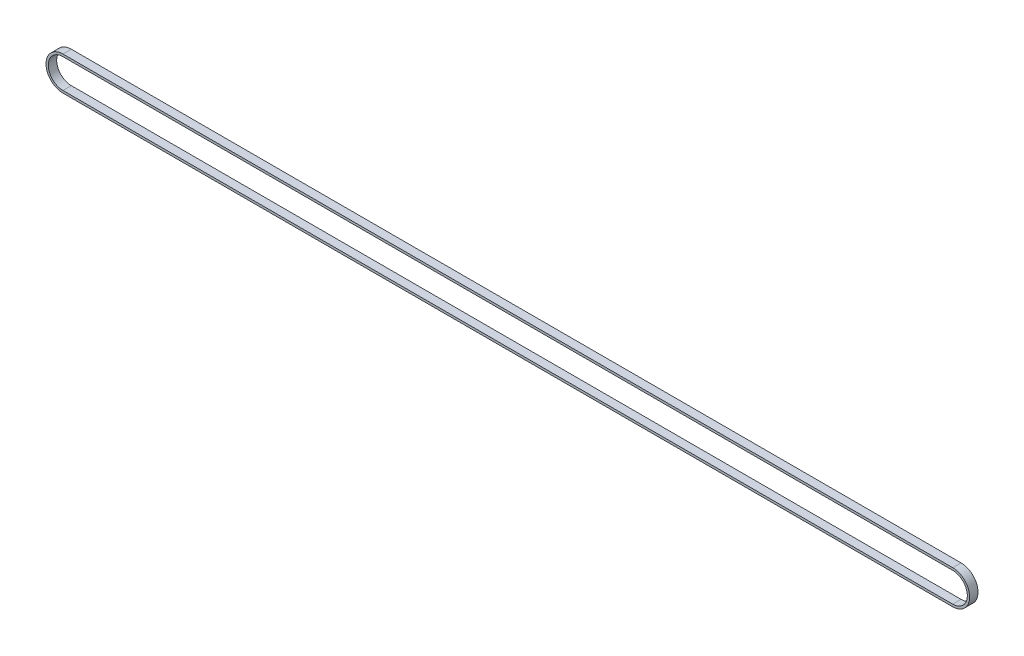
ISO-10303-21;
HEADER;
FILE_DESCRIPTION(('STEP AP214'),'2;1');
FILE_NAME('part.step','',(''),(''),'','','');
FILE_SCHEMA(('AUTOMOTIVE_DESIGN { 1 0 10303 214 1 1 1 1 }'));
ENDSEC;
DATA;
#1=APPLICATION_CONTEXT('core data for automotive mechanical design processes');
#2=APPLICATION_PROTOCOL_DEFINITION('international standard','automotive_design',2000,#1);
#3=PRODUCT_CONTEXT('',#1,'mechanical');
#4=PRODUCT('Part','Part','',(#3));
#5=PRODUCT_RELATED_PRODUCT_CATEGORY('part','',(#4));
#6=PRODUCT_DEFINITION_FORMATION('','',#4);
#7=PRODUCT_DEFINITION_CONTEXT('part definition',#1,'design');
#8=PRODUCT_DEFINITION('design','',#6,#7);
#9=PRODUCT_DEFINITION_SHAPE('','',#8);
#10=(LENGTH_UNIT() NAMED_UNIT(*) SI_UNIT(.MILLI.,.METRE.));
#11=(NAMED_UNIT(*) PLANE_ANGLE_UNIT() SI_UNIT($,.RADIAN.));
#12=(NAMED_UNIT(*) SI_UNIT($,.STERADIAN.) SOLID_ANGLE_UNIT());
#13=UNCERTAINTY_MEASURE_WITH_UNIT(LENGTH_MEASURE(1.E-05),#10,'distance_accuracy_value','');
#14=(GEOMETRIC_REPRESENTATION_CONTEXT(3) GLOBAL_UNCERTAINTY_ASSIGNED_CONTEXT((#13)) GLOBAL_UNIT_ASSIGNED_CONTEXT((#10,
#11,#12)) REPRESENTATION_CONTEXT('',''));
#15=CARTESIAN_POINT('',(0.,0.,0.));
#16=DIRECTION('',(0.,0.,1.));
#17=DIRECTION('',(1.,0.,0.));
#18=AXIS2_PLACEMENT_3D('',#15,#16,#17);
#19=CARTESIAN_POINT('',(0.,0.,2.5));
#20=DIRECTION('',(0.,0.,1.));
#21=DIRECTION('',(1.,0.,0.));
#22=AXIS2_PLACEMENT_3D('',#19,#20,#21);
#23=PLANE('',#22);
#24=CARTESIAN_POINT('',(0.,0.,2.5));
#25=DIRECTION('',(0.,0.,1.));
#26=DIRECTION('',(1.,0.,0.));
#27=AXIS2_PLACEMENT_3D('',#24,#25,#26);
#28=CIRCLE('',#27,10.13);
#29=CARTESIAN_POINT('',(0.,10.13,2.5));
#30=VERTEX_POINT('',#29);
#31=CARTESIAN_POINT('',(0.,-10.13,2.5));
#32=VERTEX_POINT('',#31);
#33=EDGE_CURVE('E157',#30,#32,#28,.T.);
#34=ORIENTED_EDGE('',*,*,#33,.T.);
#35=DIRECTION('',(1.,0.,0.));
#36=VECTOR('',#35,1.);
#37=CARTESIAN_POINT('',(532.,-10.13,2.5));
#38=LINE('',#37,#36);
#39=CARTESIAN_POINT('',(532.,-10.13,2.5));
#40=VERTEX_POINT('',#39);
#41=EDGE_CURVE('E160',#32,#40,#38,.T.);
#42=ORIENTED_EDGE('',*,*,#41,.T.);
#43=CARTESIAN_POINT('',(532.,0.,2.5));
#44=DIRECTION('',(0.,0.,1.));
#45=DIRECTION('',(1.,0.,0.));
#46=AXIS2_PLACEMENT_3D('',#43,#44,#45);
#47=CIRCLE('',#46,10.13);
#48=CARTESIAN_POINT('',(532.,10.13,2.5));
#49=VERTEX_POINT('',#48);
#50=EDGE_CURVE('E163',#40,#49,#47,.T.);
#51=ORIENTED_EDGE('',*,*,#50,.T.);
#52=DIRECTION('',(-1.,0.,0.));
#53=VECTOR('',#52,1.);
#54=CARTESIAN_POINT('',(0.,10.13,2.5));
#55=LINE('',#54,#53);
#56=EDGE_CURVE('E165',#49,#30,#55,.T.);
#57=ORIENTED_EDGE('',*,*,#56,.T.);
#58=EDGE_LOOP('',(#34,#42,#51,#57));
#59=FACE_BOUND('',#58,.T.);
#60=DIRECTION('',(1.,0.,0.));
#61=VECTOR('',#60,1.);
#62=CARTESIAN_POINT('',(532.,-8.75,2.5));
#63=LINE('',#62,#61);
#64=CARTESIAN_POINT('',(0.,-8.75,2.5));
#65=VERTEX_POINT('',#64);
#66=CARTESIAN_POINT('',(532.,-8.75,2.5));
#67=VERTEX_POINT('',#66);
#68=EDGE_CURVE('E129',#65,#67,#63,.T.);
#69=ORIENTED_EDGE('',*,*,#68,.F.);
#70=CARTESIAN_POINT('',(0.,0.,2.5));
#71=DIRECTION('',(0.,0.,1.));
#72=DIRECTION('',(1.,0.,0.));
#73=AXIS2_PLACEMENT_3D('',#70,#71,#72);
#74=CIRCLE('',#73,8.75);
#75=CARTESIAN_POINT('',(0.,8.75,2.5));
#76=VERTEX_POINT('',#75);
#77=EDGE_CURVE('E121',#76,#65,#74,.T.);
#78=ORIENTED_EDGE('',*,*,#77,.F.);
#79=DIRECTION('',(-1.,0.,0.));
#80=VECTOR('',#79,1.);
#81=CARTESIAN_POINT('',(0.,8.75,2.5));
#82=LINE('',#81,#80);
#83=CARTESIAN_POINT('',(532.,8.75,2.5));
#84=VERTEX_POINT('',#83);
#85=EDGE_CURVE('E143',#84,#76,#82,.T.);
#86=ORIENTED_EDGE('',*,*,#85,.F.);
#87=CARTESIAN_POINT('',(532.,0.,2.5));
#88=DIRECTION('',(0.,0.,1.));
#89=DIRECTION('',(1.,0.,0.));
#90=AXIS2_PLACEMENT_3D('',#87,#88,#89);
#91=CIRCLE('',#90,8.75);
#92=EDGE_CURVE('E141',#67,#84,#91,.T.);
#93=ORIENTED_EDGE('',*,*,#92,.F.);
#94=EDGE_LOOP('',(#69,#78,#86,#93));
#95=FACE_BOUND('',#94,.T.);
#96=ADVANCED_FACE('F56',(#59,#95),#23,.T.);
#97=CARTESIAN_POINT('',(0.,0.,-2.5));
#98=DIRECTION('',(0.,0.,1.));
#99=DIRECTION('',(1.,0.,0.));
#100=AXIS2_PLACEMENT_3D('',#97,#98,#99);
#101=PLANE('',#100);
#102=CARTESIAN_POINT('',(0.,0.,-2.5));
#103=DIRECTION('',(0.,0.,1.));
#104=DIRECTION('',(1.,0.,0.));
#105=AXIS2_PLACEMENT_3D('',#102,#103,#104);
#106=CIRCLE('',#105,10.13);
#107=CARTESIAN_POINT('',(0.,10.13,-2.5));
#108=VERTEX_POINT('',#107);
#109=CARTESIAN_POINT('',(0.,-10.13,-2.5));
#110=VERTEX_POINT('',#109);
#111=EDGE_CURVE('E137',#108,#110,#106,.T.);
#112=ORIENTED_EDGE('',*,*,#111,.F.);
#113=DIRECTION('',(-1.,0.,0.));
#114=VECTOR('',#113,1.);
#115=CARTESIAN_POINT('',(0.,10.13,-2.5));
#116=LINE('',#115,#114);
#117=CARTESIAN_POINT('',(532.,10.13,-2.5));
#118=VERTEX_POINT('',#117);
#119=EDGE_CURVE('E161',#118,#108,#116,.T.);
#120=ORIENTED_EDGE('',*,*,#119,.F.);
#121=CARTESIAN_POINT('',(532.,0.,-2.5));
#122=DIRECTION('',(0.,0.,1.));
#123=DIRECTION('',(1.,0.,0.));
#124=AXIS2_PLACEMENT_3D('',#121,#122,#123);
#125=CIRCLE('',#124,10.13);
#126=CARTESIAN_POINT('',(532.,-10.13,-2.5));
#127=VERTEX_POINT('',#126);
#128=EDGE_CURVE('E172',#127,#118,#125,.T.);
#129=ORIENTED_EDGE('',*,*,#128,.F.);
#130=DIRECTION('',(1.,0.,0.));
#131=VECTOR('',#130,1.);
#132=CARTESIAN_POINT('',(532.,-10.13,-2.5));
#133=LINE('',#132,#131);
#134=EDGE_CURVE('E170',#110,#127,#133,.T.);
#135=ORIENTED_EDGE('',*,*,#134,.F.);
#136=EDGE_LOOP('',(#112,#120,#129,#135));
#137=FACE_BOUND('',#136,.T.);
#138=CARTESIAN_POINT('',(0.,0.,-2.5));
#139=DIRECTION('',(0.,0.,1.));
#140=DIRECTION('',(1.,0.,0.));
#141=AXIS2_PLACEMENT_3D('',#138,#139,#140);
#142=CIRCLE('',#141,8.75);
#143=CARTESIAN_POINT('',(0.,8.75,-2.5));
#144=VERTEX_POINT('',#143);
#145=CARTESIAN_POINT('',(0.,-8.75,-2.5));
#146=VERTEX_POINT('',#145);
#147=EDGE_CURVE('E79',#144,#146,#142,.T.);
#148=ORIENTED_EDGE('',*,*,#147,.T.);
#149=DIRECTION('',(1.,0.,0.));
#150=VECTOR('',#149,1.);
#151=CARTESIAN_POINT('',(532.,-8.75,-2.5));
#152=LINE('',#151,#150);
#153=CARTESIAN_POINT('',(532.,-8.75,-2.5));
#154=VERTEX_POINT('',#153);
#155=EDGE_CURVE('E136',#146,#154,#152,.T.);
#156=ORIENTED_EDGE('',*,*,#155,.T.);
#157=CARTESIAN_POINT('',(532.,0.,-2.5));
#158=DIRECTION('',(0.,0.,1.));
#159=DIRECTION('',(1.,0.,0.));
#160=AXIS2_PLACEMENT_3D('',#157,#158,#159);
#161=CIRCLE('',#160,8.75);
#162=CARTESIAN_POINT('',(532.,8.75,-2.5));
#163=VERTEX_POINT('',#162);
#164=EDGE_CURVE('E149',#154,#163,#161,.T.);
#165=ORIENTED_EDGE('',*,*,#164,.T.);
#166=DIRECTION('',(-1.,0.,0.));
#167=VECTOR('',#166,1.);
#168=CARTESIAN_POINT('',(0.,8.75,-2.5));
#169=LINE('',#168,#167);
#170=EDGE_CURVE('E130',#163,#144,#169,.T.);
#171=ORIENTED_EDGE('',*,*,#170,.T.);
#172=EDGE_LOOP('',(#148,#156,#165,#171));
#173=FACE_BOUND('',#172,.T.);
#174=ADVANCED_FACE('F190',(#137,#173),#101,.F.);
#175=CARTESIAN_POINT('',(0.,0.,2.5));
#176=DIRECTION('',(0.,0.,-1.));
#177=DIRECTION('',(-1.,0.,0.));
#178=AXIS2_PLACEMENT_3D('',#175,#176,#177);
#179=CYLINDRICAL_SURFACE('',#178,10.13);
#180=ORIENTED_EDGE('',*,*,#111,.T.);
#181=DIRECTION('',(0.,0.,-1.));
#182=VECTOR('',#181,1.);
#183=CARTESIAN_POINT('',(0.,-10.13,2.5));
#184=LINE('',#183,#182);
#185=EDGE_CURVE('E12',#32,#110,#184,.T.);
#186=ORIENTED_EDGE('',*,*,#185,.F.);
#187=ORIENTED_EDGE('',*,*,#33,.F.);
#188=DIRECTION('',(0.,0.,-1.));
#189=VECTOR('',#188,1.);
#190=CARTESIAN_POINT('',(0.,10.13,2.5));
#191=LINE('',#190,#189);
#192=EDGE_CURVE('E167',#30,#108,#191,.T.);
#193=ORIENTED_EDGE('',*,*,#192,.T.);
#194=EDGE_LOOP('',(#180,#186,#187,#193));
#195=FACE_BOUND('',#194,.T.);
#196=ADVANCED_FACE('F58',(#195),#179,.T.);
#197=CARTESIAN_POINT('',(532.,-10.13,2.5));
#198=DIRECTION('',(0.,1.,0.));
#199=DIRECTION('',(0.,0.,1.));
#200=AXIS2_PLACEMENT_3D('',#197,#198,#199);
#201=PLANE('',#200);
#202=ORIENTED_EDGE('',*,*,#134,.T.);
#203=DIRECTION('',(0.,0.,-1.));
#204=VECTOR('',#203,1.);
#205=CARTESIAN_POINT('',(532.,-10.13,2.5));
#206=LINE('',#205,#204);
#207=EDGE_CURVE('E64',#40,#127,#206,.T.);
#208=ORIENTED_EDGE('',*,*,#207,.F.);
#209=ORIENTED_EDGE('',*,*,#41,.F.);
#210=ORIENTED_EDGE('',*,*,#185,.T.);
#211=EDGE_LOOP('',(#202,#208,#209,#210));
#212=FACE_BOUND('',#211,.T.);
#213=ADVANCED_FACE('F200',(#212),#201,.F.);
#214=CARTESIAN_POINT('',(532.,0.,2.5));
#215=DIRECTION('',(0.,0.,-1.));
#216=DIRECTION('',(-1.,0.,0.));
#217=AXIS2_PLACEMENT_3D('',#214,#215,#216);
#218=CYLINDRICAL_SURFACE('',#217,10.13);
#219=ORIENTED_EDGE('',*,*,#128,.T.);
#220=DIRECTION('',(0.,0.,-1.));
#221=VECTOR('',#220,1.);
#222=CARTESIAN_POINT('',(532.,10.13,2.5));
#223=LINE('',#222,#221);
#224=EDGE_CURVE('E177',#49,#118,#223,.T.);
#225=ORIENTED_EDGE('',*,*,#224,.F.);
#226=ORIENTED_EDGE('',*,*,#50,.F.);
#227=ORIENTED_EDGE('',*,*,#207,.T.);
#228=EDGE_LOOP('',(#219,#225,#226,#227));
#229=FACE_BOUND('',#228,.T.);
#230=ADVANCED_FACE('F184',(#229),#218,.T.);
#231=CARTESIAN_POINT('',(0.,10.13,2.5));
#232=DIRECTION('',(0.,-1.,0.));
#233=DIRECTION('',(0.,0.,-1.));
#234=AXIS2_PLACEMENT_3D('',#231,#232,#233);
#235=PLANE('',#234);
#236=ORIENTED_EDGE('',*,*,#119,.T.);
#237=ORIENTED_EDGE('',*,*,#192,.F.);
#238=ORIENTED_EDGE('',*,*,#56,.F.);
#239=ORIENTED_EDGE('',*,*,#224,.T.);
#240=EDGE_LOOP('',(#236,#237,#238,#239));
#241=FACE_BOUND('',#240,.T.);
#242=ADVANCED_FACE('F194',(#241),#235,.F.);
#243=CARTESIAN_POINT('',(0.,0.,2.5));
#244=DIRECTION('',(0.,0.,-1.));
#245=DIRECTION('',(-1.,0.,0.));
#246=AXIS2_PLACEMENT_3D('',#243,#244,#245);
#247=CYLINDRICAL_SURFACE('',#246,8.75);
#248=ORIENTED_EDGE('',*,*,#147,.F.);
#249=DIRECTION('',(0.,0.,-1.));
#250=VECTOR('',#249,1.);
#251=CARTESIAN_POINT('',(0.,8.75,2.5));
#252=LINE('',#251,#250);
#253=EDGE_CURVE('E125',#76,#144,#252,.T.);
#254=ORIENTED_EDGE('',*,*,#253,.F.);
#255=ORIENTED_EDGE('',*,*,#77,.T.);
#256=DIRECTION('',(0.,0.,-1.));
#257=VECTOR('',#256,1.);
#258=CARTESIAN_POINT('',(0.,-8.75,2.5));
#259=LINE('',#258,#257);
#260=EDGE_CURVE('E124',#65,#146,#259,.T.);
#261=ORIENTED_EDGE('',*,*,#260,.T.);
#262=EDGE_LOOP('',(#248,#254,#255,#261));
#263=FACE_BOUND('',#262,.T.);
#264=ADVANCED_FACE('F123',(#263),#247,.F.);
#265=CARTESIAN_POINT('',(532.,-8.75,2.5));
#266=DIRECTION('',(0.,1.,0.));
#267=DIRECTION('',(0.,0.,1.));
#268=AXIS2_PLACEMENT_3D('',#265,#266,#267);
#269=PLANE('',#268);
#270=ORIENTED_EDGE('',*,*,#155,.F.);
#271=ORIENTED_EDGE('',*,*,#260,.F.);
#272=ORIENTED_EDGE('',*,*,#68,.T.);
#273=DIRECTION('',(0.,0.,-1.));
#274=VECTOR('',#273,1.);
#275=CARTESIAN_POINT('',(532.,-8.75,2.5));
#276=LINE('',#275,#274);
#277=EDGE_CURVE('E138',#67,#154,#276,.T.);
#278=ORIENTED_EDGE('',*,*,#277,.T.);
#279=EDGE_LOOP('',(#270,#271,#272,#278));
#280=FACE_BOUND('',#279,.T.);
#281=ADVANCED_FACE('F133',(#280),#269,.T.);
#282=CARTESIAN_POINT('',(532.,0.,2.5));
#283=DIRECTION('',(0.,0.,-1.));
#284=DIRECTION('',(-1.,0.,0.));
#285=AXIS2_PLACEMENT_3D('',#282,#283,#284);
#286=CYLINDRICAL_SURFACE('',#285,8.75);
#287=ORIENTED_EDGE('',*,*,#164,.F.);
#288=ORIENTED_EDGE('',*,*,#277,.F.);
#289=ORIENTED_EDGE('',*,*,#92,.T.);
#290=DIRECTION('',(0.,0.,-1.));
#291=VECTOR('',#290,1.);
#292=CARTESIAN_POINT('',(532.,8.75,2.5));
#293=LINE('',#292,#291);
#294=EDGE_CURVE('E71',#84,#163,#293,.T.);
#295=ORIENTED_EDGE('',*,*,#294,.T.);
#296=EDGE_LOOP('',(#287,#288,#289,#295));
#297=FACE_BOUND('',#296,.T.);
#298=ADVANCED_FACE('F223',(#297),#286,.F.);
#299=CARTESIAN_POINT('',(0.,8.75,2.5));
#300=DIRECTION('',(0.,-1.,0.));
#301=DIRECTION('',(0.,0.,-1.));
#302=AXIS2_PLACEMENT_3D('',#299,#300,#301);
#303=PLANE('',#302);
#304=ORIENTED_EDGE('',*,*,#170,.F.);
#305=ORIENTED_EDGE('',*,*,#294,.F.);
#306=ORIENTED_EDGE('',*,*,#85,.T.);
#307=ORIENTED_EDGE('',*,*,#253,.T.);
#308=EDGE_LOOP('',(#304,#305,#306,#307));
#309=FACE_BOUND('',#308,.T.);
#310=ADVANCED_FACE('F227',(#309),#303,.T.);
#311=CLOSED_SHELL('',(#96,#174,#196,#213,#230,#242,#264,#281,#298,#310));
#312=MANIFOLD_SOLID_BREP('B2',#311);
#313=ADVANCED_BREP_SHAPE_REPRESENTATION('',(#18,#312),#14);
#314=SHAPE_DEFINITION_REPRESENTATION(#9,#313);
ENDSEC;
END-ISO-10303-21;
